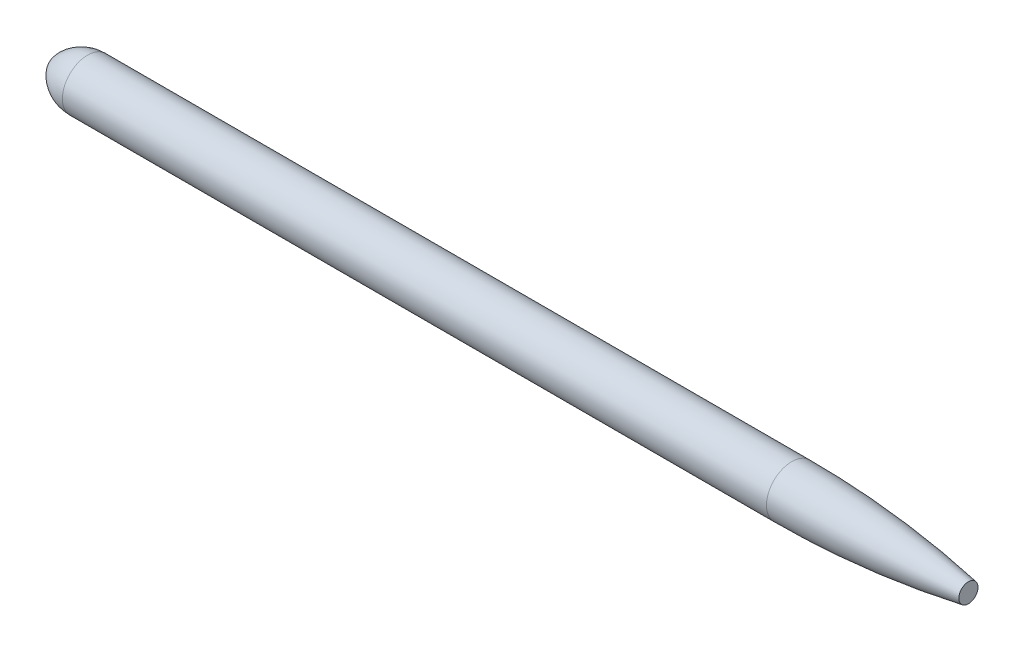
ISO-10303-21;
HEADER;
FILE_DESCRIPTION(('STEP AP214'),'2;1');
FILE_NAME('part.step','',(''),(''),'','','');
FILE_SCHEMA(('AUTOMOTIVE_DESIGN { 1 0 10303 214 1 1 1 1 }'));
ENDSEC;
DATA;
#1=APPLICATION_CONTEXT('core data for automotive mechanical design processes');
#2=APPLICATION_PROTOCOL_DEFINITION('international standard','automotive_design',2000,#1);
#3=PRODUCT_CONTEXT('',#1,'mechanical');
#4=PRODUCT('Part','Part','',(#3));
#5=PRODUCT_RELATED_PRODUCT_CATEGORY('part','',(#4));
#6=PRODUCT_DEFINITION_FORMATION('','',#4);
#7=PRODUCT_DEFINITION_CONTEXT('part definition',#1,'design');
#8=PRODUCT_DEFINITION('design','',#6,#7);
#9=PRODUCT_DEFINITION_SHAPE('','',#8);
#10=(LENGTH_UNIT() NAMED_UNIT(*) SI_UNIT(.MILLI.,.METRE.));
#11=(NAMED_UNIT(*) PLANE_ANGLE_UNIT() SI_UNIT($,.RADIAN.));
#12=(NAMED_UNIT(*) SI_UNIT($,.STERADIAN.) SOLID_ANGLE_UNIT());
#13=UNCERTAINTY_MEASURE_WITH_UNIT(LENGTH_MEASURE(1.E-05),#10,'distance_accuracy_value','');
#14=(GEOMETRIC_REPRESENTATION_CONTEXT(3) GLOBAL_UNCERTAINTY_ASSIGNED_CONTEXT((#13)) GLOBAL_UNIT_ASSIGNED_CONTEXT((#10,
#11,#12)) REPRESENTATION_CONTEXT('',''));
#15=CARTESIAN_POINT('',(0.,0.,0.));
#16=DIRECTION('',(0.,0.,1.));
#17=DIRECTION('',(1.,0.,0.));
#18=AXIS2_PLACEMENT_3D('',#15,#16,#17);
#19=CARTESIAN_POINT('',(270.,-105.830052442584,0.));
#20=DIRECTION('',(0.,0.,-1.));
#21=DIRECTION('',(0.,1.,0.));
#22=AXIS2_PLACEMENT_3D('',#19,#20,#21);
#23=CIRCLE('',#22,290.);
#24=TRIMMED_CURVE('',#23,(PARAMETER_VALUE(-1.19723740463171)),
(PARAMETER_VALUE(1.19723740463171)),.T.,.PARAMETER.);
#25=CARTESIAN_POINT('',(270.,0.,0.));
#26=DIRECTION('',(1.,0.,0.));
#27=AXIS1_PLACEMENT('',#25,#26);
#28=SURFACE_OF_REVOLUTION('',#24,#27);
#29=CARTESIAN_POINT('',(0.,0.,0.));
#30=VERTEX_POINT('',#29);
#31=VERTEX_LOOP('',#30);
#32=FACE_BOUND('',#31,.T.);
#33=CARTESIAN_POINT('',(270.,0.,0.));
#34=DIRECTION('',(1.,0.,0.));
#35=DIRECTION('',(0.,1.,0.));
#36=AXIS2_PLACEMENT_3D('',#33,#34,#35);
#37=CIRCLE('',#36,184.169947557417);
#38=CARTESIAN_POINT('',(270.,184.169947557417,0.));
#39=VERTEX_POINT('',#38);
#40=EDGE_CURVE('E46',#39,#39,#37,.T.);
#41=ORIENTED_EDGE('',*,*,#40,.F.);
#42=EDGE_LOOP('',(#41));
#43=FACE_BOUND('',#42,.T.);
#44=ADVANCED_FACE('F32',(#32,#43),#28,.T.);
#45=CARTESIAN_POINT('',(6700.,70.,0.));
#46=DIRECTION('',(1.,0.,0.));
#47=DIRECTION('',(0.,1.,0.));
#48=AXIS2_PLACEMENT_3D('',#45,#46,#47);
#49=PLANE('',#48);
#50=CARTESIAN_POINT('',(6700.,0.,0.));
#51=DIRECTION('',(1.,0.,0.));
#52=DIRECTION('',(0.,1.,0.));
#53=AXIS2_PLACEMENT_3D('',#50,#51,#52);
#54=CIRCLE('',#53,70.);
#55=CARTESIAN_POINT('',(6700.,70.,0.));
#56=VERTEX_POINT('',#55);
#57=EDGE_CURVE('E11',#56,#56,#54,.T.);
#58=ORIENTED_EDGE('',*,*,#57,.T.);
#59=EDGE_LOOP('',(#58));
#60=FACE_BOUND('',#59,.T.);
#61=ADVANCED_FACE('F43',(#60),#49,.T.);
#62=CARTESIAN_POINT('',(5410.,0.,0.));
#63=DIRECTION('',(1.,0.,0.));
#64=DIRECTION('',(0.,1.,0.));
#65=AXIS2_PLACEMENT_3D('',#62,#63,#64);
#66=DEGENERATE_TOROIDAL_SURFACE('',#65,7160.73478791084,7344.90473546826,.F.);
#67=CARTESIAN_POINT('',(5410.,0.,0.));
#68=DIRECTION('',(1.,0.,0.));
#69=DIRECTION('',(0.,1.,0.));
#70=AXIS2_PLACEMENT_3D('',#67,#68,#69);
#71=CIRCLE('',#70,184.169947557416);
#72=CARTESIAN_POINT('',(5410.,184.169947557416,0.));
#73=VERTEX_POINT('',#72);
#74=EDGE_CURVE('E38',#73,#73,#71,.T.);
#75=ORIENTED_EDGE('',*,*,#74,.T.);
#76=EDGE_LOOP('',(#75));
#77=FACE_BOUND('',#76,.T.);
#78=ORIENTED_EDGE('',*,*,#57,.F.);
#79=EDGE_LOOP('',(#78));
#80=FACE_BOUND('',#79,.T.);
#81=ADVANCED_FACE('F52',(#77,#80),#66,.F.);
#82=CARTESIAN_POINT('',(6700.,0.,0.));
#83=DIRECTION('',(1.,0.,0.));
#84=DIRECTION('',(0.,1.,0.));
#85=AXIS2_PLACEMENT_3D('',#82,#83,#84);
#86=CYLINDRICAL_SURFACE('',#85,184.169947557416);
#87=ORIENTED_EDGE('',*,*,#40,.T.);
#88=EDGE_LOOP('',(#87));
#89=FACE_BOUND('',#88,.T.);
#90=ORIENTED_EDGE('',*,*,#74,.F.);
#91=EDGE_LOOP('',(#90));
#92=FACE_BOUND('',#91,.T.);
#93=ADVANCED_FACE('F55',(#89,#92),#86,.T.);
#94=CLOSED_SHELL('',(#44,#61,#81,#93));
#95=MANIFOLD_SOLID_BREP('B2',#94);
#96=ADVANCED_BREP_SHAPE_REPRESENTATION('',(#18,#95),#14);
#97=SHAPE_DEFINITION_REPRESENTATION(#9,#96);
ENDSEC;
END-ISO-10303-21;
